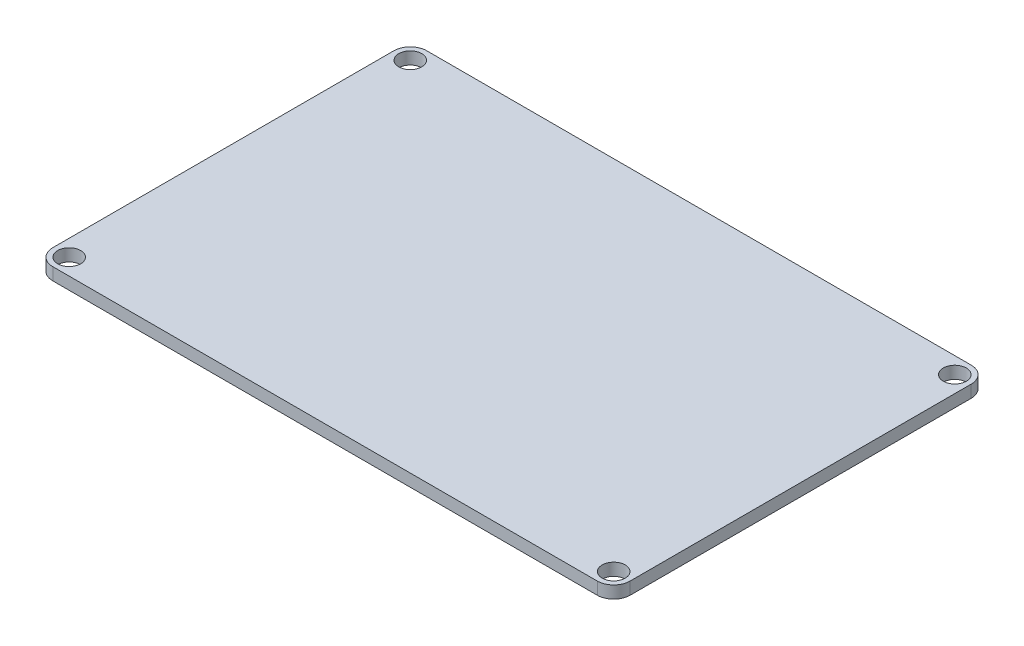
ISO-10303-21;
HEADER;
FILE_DESCRIPTION(('STEP AP214'),'2;1');
FILE_NAME('part.step','',(''),(''),'','','');
FILE_SCHEMA(('AUTOMOTIVE_DESIGN { 1 0 10303 214 1 1 1 1 }'));
ENDSEC;
DATA;
#1=APPLICATION_CONTEXT('core data for automotive mechanical design processes');
#2=APPLICATION_PROTOCOL_DEFINITION('international standard','automotive_design',2000,#1);
#3=PRODUCT_CONTEXT('',#1,'mechanical');
#4=PRODUCT('Part','Part','',(#3));
#5=PRODUCT_RELATED_PRODUCT_CATEGORY('part','',(#4));
#6=PRODUCT_DEFINITION_FORMATION('','',#4);
#7=PRODUCT_DEFINITION_CONTEXT('part definition',#1,'design');
#8=PRODUCT_DEFINITION('design','',#6,#7);
#9=PRODUCT_DEFINITION_SHAPE('','',#8);
#10=(LENGTH_UNIT() NAMED_UNIT(*) SI_UNIT(.MILLI.,.METRE.));
#11=(NAMED_UNIT(*) PLANE_ANGLE_UNIT() SI_UNIT($,.RADIAN.));
#12=(NAMED_UNIT(*) SI_UNIT($,.STERADIAN.) SOLID_ANGLE_UNIT());
#13=UNCERTAINTY_MEASURE_WITH_UNIT(LENGTH_MEASURE(1.E-05),#10,'distance_accuracy_value','');
#14=(GEOMETRIC_REPRESENTATION_CONTEXT(3) GLOBAL_UNCERTAINTY_ASSIGNED_CONTEXT((#13)) GLOBAL_UNIT_ASSIGNED_CONTEXT((#10,
#11,#12)) REPRESENTATION_CONTEXT('',''));
#15=CARTESIAN_POINT('',(0.,0.,0.));
#16=DIRECTION('',(0.,0.,1.));
#17=DIRECTION('',(1.,0.,0.));
#18=AXIS2_PLACEMENT_3D('',#15,#16,#17);
#19=CARTESIAN_POINT('',(-78.5,73.,41.5));
#20=DIRECTION('',(0.,1.,0.));
#21=DIRECTION('',(0.,0.,1.));
#22=AXIS2_PLACEMENT_3D('',#19,#20,#21);
#23=PLANE('',#22);
#24=CARTESIAN_POINT('',(-78.5,73.,41.5));
#25=DIRECTION('',(0.,1.,0.));
#26=DIRECTION('',(0.,0.,1.));
#27=AXIS2_PLACEMENT_3D('',#24,#25,#26);
#28=CIRCLE('',#27,2.79999999999999);
#29=CARTESIAN_POINT('',(-78.5,73.,44.3));
#30=VERTEX_POINT('',#29);
#31=EDGE_CURVE('E229',#30,#30,#28,.T.);
#32=ORIENTED_EDGE('',*,*,#31,.F.);
#33=EDGE_LOOP('',(#32));
#34=FACE_BOUND('',#33,.T.);
#35=CARTESIAN_POINT('',(54.,73.,-41.5));
#36=DIRECTION('',(0.,1.,0.));
#37=DIRECTION('',(0.,0.,1.));
#38=AXIS2_PLACEMENT_3D('',#35,#36,#37);
#39=CIRCLE('',#38,2.8);
#40=CARTESIAN_POINT('',(54.,73.,-38.7));
#41=VERTEX_POINT('',#40);
#42=EDGE_CURVE('E175',#41,#41,#39,.T.);
#43=ORIENTED_EDGE('',*,*,#42,.F.);
#44=EDGE_LOOP('',(#43));
#45=FACE_BOUND('',#44,.T.);
#46=CARTESIAN_POINT('',(-78.5,73.,41.5));
#47=DIRECTION('',(0.,1.,0.));
#48=DIRECTION('',(0.,0.,1.));
#49=AXIS2_PLACEMENT_3D('',#46,#47,#48);
#50=CIRCLE('',#49,4.);
#51=CARTESIAN_POINT('',(-82.5,73.,41.5));
#52=VERTEX_POINT('',#51);
#53=CARTESIAN_POINT('',(-78.5,73.,45.5));
#54=VERTEX_POINT('',#53);
#55=EDGE_CURVE('E186',#52,#54,#50,.T.);
#56=ORIENTED_EDGE('',*,*,#55,.T.);
#57=DIRECTION('',(1.,0.,0.));
#58=VECTOR('',#57,1.);
#59=CARTESIAN_POINT('',(-78.5,73.,45.5));
#60=LINE('',#59,#58);
#61=CARTESIAN_POINT('',(54.,73.,45.5));
#62=VERTEX_POINT('',#61);
#63=EDGE_CURVE('E134',#54,#62,#60,.T.);
#64=ORIENTED_EDGE('',*,*,#63,.T.);
#65=CARTESIAN_POINT('',(54.,73.,41.5));
#66=DIRECTION('',(0.,1.,0.));
#67=DIRECTION('',(0.,0.,1.));
#68=AXIS2_PLACEMENT_3D('',#65,#66,#67);
#69=CIRCLE('',#68,4.);
#70=CARTESIAN_POINT('',(58.,73.,41.5));
#71=VERTEX_POINT('',#70);
#72=EDGE_CURVE('E201',#62,#71,#69,.T.);
#73=ORIENTED_EDGE('',*,*,#72,.T.);
#74=DIRECTION('',(0.,0.,-1.));
#75=VECTOR('',#74,1.);
#76=CARTESIAN_POINT('',(58.,73.,41.5));
#77=LINE('',#76,#75);
#78=CARTESIAN_POINT('',(58.,73.,-41.5));
#79=VERTEX_POINT('',#78);
#80=EDGE_CURVE('E214',#71,#79,#77,.T.);
#81=ORIENTED_EDGE('',*,*,#80,.T.);
#82=CARTESIAN_POINT('',(54.,73.,-41.5));
#83=DIRECTION('',(0.,1.,0.));
#84=DIRECTION('',(0.,0.,1.));
#85=AXIS2_PLACEMENT_3D('',#82,#83,#84);
#86=CIRCLE('',#85,4.);
#87=CARTESIAN_POINT('',(54.,73.,-45.5));
#88=VERTEX_POINT('',#87);
#89=EDGE_CURVE('E153',#79,#88,#86,.T.);
#90=ORIENTED_EDGE('',*,*,#89,.T.);
#91=DIRECTION('',(-1.,0.,0.));
#92=VECTOR('',#91,1.);
#93=CARTESIAN_POINT('',(-78.5,73.,-45.5));
#94=LINE('',#93,#92);
#95=CARTESIAN_POINT('',(-78.5,73.,-45.5));
#96=VERTEX_POINT('',#95);
#97=EDGE_CURVE('E147',#88,#96,#94,.T.);
#98=ORIENTED_EDGE('',*,*,#97,.T.);
#99=CARTESIAN_POINT('',(-78.5,73.,-41.5));
#100=DIRECTION('',(0.,1.,0.));
#101=DIRECTION('',(0.,0.,1.));
#102=AXIS2_PLACEMENT_3D('',#99,#100,#101);
#103=CIRCLE('',#102,4.);
#104=CARTESIAN_POINT('',(-82.5,73.,-41.5));
#105=VERTEX_POINT('',#104);
#106=EDGE_CURVE('E151',#96,#105,#103,.T.);
#107=ORIENTED_EDGE('',*,*,#106,.T.);
#108=DIRECTION('',(0.,0.,1.));
#109=VECTOR('',#108,1.);
#110=CARTESIAN_POINT('',(-82.5,73.,41.5));
#111=LINE('',#110,#109);
#112=EDGE_CURVE('E91',#105,#52,#111,.T.);
#113=ORIENTED_EDGE('',*,*,#112,.T.);
#114=EDGE_LOOP('',(#56,#64,#73,#81,#90,#98,#107,#113));
#115=FACE_BOUND('',#114,.T.);
#116=CARTESIAN_POINT('',(54.,73.,41.5));
#117=DIRECTION('',(0.,1.,0.));
#118=DIRECTION('',(0.,0.,1.));
#119=AXIS2_PLACEMENT_3D('',#116,#117,#118);
#120=CIRCLE('',#119,2.8);
#121=CARTESIAN_POINT('',(54.,73.,44.3));
#122=VERTEX_POINT('',#121);
#123=EDGE_CURVE('E223',#122,#122,#120,.T.);
#124=ORIENTED_EDGE('',*,*,#123,.F.);
#125=EDGE_LOOP('',(#124));
#126=FACE_BOUND('',#125,.T.);
#127=CARTESIAN_POINT('',(-78.5,73.,-41.5));
#128=DIRECTION('',(0.,1.,0.));
#129=DIRECTION('',(0.,0.,1.));
#130=AXIS2_PLACEMENT_3D('',#127,#128,#129);
#131=CIRCLE('',#130,2.79999999999999);
#132=CARTESIAN_POINT('',(-78.5,73.,-38.7));
#133=VERTEX_POINT('',#132);
#134=EDGE_CURVE('E235',#133,#133,#131,.T.);
#135=ORIENTED_EDGE('',*,*,#134,.F.);
#136=EDGE_LOOP('',(#135));
#137=FACE_BOUND('',#136,.T.);
#138=ADVANCED_FACE('F74',(#34,#45,#115,#126,#137),#23,.T.);
#139=CARTESIAN_POINT('',(-78.5,70.,41.5));
#140=DIRECTION('',(0.,1.,0.));
#141=DIRECTION('',(0.,0.,1.));
#142=AXIS2_PLACEMENT_3D('',#139,#140,#141);
#143=PLANE('',#142);
#144=CARTESIAN_POINT('',(-78.5,70.,41.5));
#145=DIRECTION('',(0.,1.,0.));
#146=DIRECTION('',(0.,0.,1.));
#147=AXIS2_PLACEMENT_3D('',#144,#145,#146);
#148=CIRCLE('',#147,4.);
#149=CARTESIAN_POINT('',(-82.5,70.,41.5));
#150=VERTEX_POINT('',#149);
#151=CARTESIAN_POINT('',(-78.5,70.,45.5));
#152=VERTEX_POINT('',#151);
#153=EDGE_CURVE('E171',#150,#152,#148,.T.);
#154=ORIENTED_EDGE('',*,*,#153,.F.);
#155=DIRECTION('',(0.,0.,1.));
#156=VECTOR('',#155,1.);
#157=CARTESIAN_POINT('',(-82.5,70.,41.5));
#158=LINE('',#157,#156);
#159=CARTESIAN_POINT('',(-82.5,70.,-41.5));
#160=VERTEX_POINT('',#159);
#161=EDGE_CURVE('E126',#160,#150,#158,.T.);
#162=ORIENTED_EDGE('',*,*,#161,.F.);
#163=CARTESIAN_POINT('',(-78.5,70.,-41.5));
#164=DIRECTION('',(0.,1.,0.));
#165=DIRECTION('',(0.,0.,1.));
#166=AXIS2_PLACEMENT_3D('',#163,#164,#165);
#167=CIRCLE('',#166,4.);
#168=CARTESIAN_POINT('',(-78.5,70.,-45.5));
#169=VERTEX_POINT('',#168);
#170=EDGE_CURVE('E120',#169,#160,#167,.T.);
#171=ORIENTED_EDGE('',*,*,#170,.F.);
#172=DIRECTION('',(-1.,0.,0.));
#173=VECTOR('',#172,1.);
#174=CARTESIAN_POINT('',(-78.5,70.,-45.5));
#175=LINE('',#174,#173);
#176=CARTESIAN_POINT('',(54.,70.,-45.5));
#177=VERTEX_POINT('',#176);
#178=EDGE_CURVE('E161',#177,#169,#175,.T.);
#179=ORIENTED_EDGE('',*,*,#178,.F.);
#180=CARTESIAN_POINT('',(54.,70.,-41.5));
#181=DIRECTION('',(0.,1.,0.));
#182=DIRECTION('',(0.,0.,1.));
#183=AXIS2_PLACEMENT_3D('',#180,#181,#182);
#184=CIRCLE('',#183,4.);
#185=CARTESIAN_POINT('',(58.,70.,-41.5));
#186=VERTEX_POINT('',#185);
#187=EDGE_CURVE('E181',#186,#177,#184,.T.);
#188=ORIENTED_EDGE('',*,*,#187,.F.);
#189=DIRECTION('',(0.,0.,-1.));
#190=VECTOR('',#189,1.);
#191=CARTESIAN_POINT('',(58.,70.,41.5));
#192=LINE('',#191,#190);
#193=CARTESIAN_POINT('',(58.,70.,41.5));
#194=VERTEX_POINT('',#193);
#195=EDGE_CURVE('E179',#194,#186,#192,.T.);
#196=ORIENTED_EDGE('',*,*,#195,.F.);
#197=CARTESIAN_POINT('',(54.,70.,41.5));
#198=DIRECTION('',(0.,1.,0.));
#199=DIRECTION('',(0.,0.,1.));
#200=AXIS2_PLACEMENT_3D('',#197,#198,#199);
#201=CIRCLE('',#200,4.);
#202=CARTESIAN_POINT('',(54.,70.,45.5));
#203=VERTEX_POINT('',#202);
#204=EDGE_CURVE('E177',#203,#194,#201,.T.);
#205=ORIENTED_EDGE('',*,*,#204,.F.);
#206=DIRECTION('',(1.,0.,0.));
#207=VECTOR('',#206,1.);
#208=CARTESIAN_POINT('',(-78.5,70.,45.5));
#209=LINE('',#208,#207);
#210=EDGE_CURVE('E174',#152,#203,#209,.T.);
#211=ORIENTED_EDGE('',*,*,#210,.F.);
#212=EDGE_LOOP('',(#154,#162,#171,#179,#188,#196,#205,#211));
#213=FACE_BOUND('',#212,.T.);
#214=CARTESIAN_POINT('',(54.,70.,-41.5));
#215=DIRECTION('',(0.,1.,0.));
#216=DIRECTION('',(0.,0.,1.));
#217=AXIS2_PLACEMENT_3D('',#214,#215,#216);
#218=CIRCLE('',#217,2.8);
#219=CARTESIAN_POINT('',(54.,70.,-38.7));
#220=VERTEX_POINT('',#219);
#221=EDGE_CURVE('E220',#220,#220,#218,.T.);
#222=ORIENTED_EDGE('',*,*,#221,.T.);
#223=EDGE_LOOP('',(#222));
#224=FACE_BOUND('',#223,.T.);
#225=CARTESIAN_POINT('',(54.,70.,41.5));
#226=DIRECTION('',(0.,1.,0.));
#227=DIRECTION('',(0.,0.,1.));
#228=AXIS2_PLACEMENT_3D('',#225,#226,#227);
#229=CIRCLE('',#228,2.8);
#230=CARTESIAN_POINT('',(54.,70.,44.3));
#231=VERTEX_POINT('',#230);
#232=EDGE_CURVE('E226',#231,#231,#229,.T.);
#233=ORIENTED_EDGE('',*,*,#232,.T.);
#234=EDGE_LOOP('',(#233));
#235=FACE_BOUND('',#234,.T.);
#236=CARTESIAN_POINT('',(-78.5,70.,41.5));
#237=DIRECTION('',(0.,1.,0.));
#238=DIRECTION('',(0.,0.,1.));
#239=AXIS2_PLACEMENT_3D('',#236,#237,#238);
#240=CIRCLE('',#239,2.79999999999999);
#241=CARTESIAN_POINT('',(-78.5,70.,44.3));
#242=VERTEX_POINT('',#241);
#243=EDGE_CURVE('E232',#242,#242,#240,.T.);
#244=ORIENTED_EDGE('',*,*,#243,.T.);
#245=EDGE_LOOP('',(#244));
#246=FACE_BOUND('',#245,.T.);
#247=CARTESIAN_POINT('',(-78.5,70.,-41.5));
#248=DIRECTION('',(0.,1.,0.));
#249=DIRECTION('',(0.,0.,1.));
#250=AXIS2_PLACEMENT_3D('',#247,#248,#249);
#251=CIRCLE('',#250,2.79999999999999);
#252=CARTESIAN_POINT('',(-78.5,70.,-38.7));
#253=VERTEX_POINT('',#252);
#254=EDGE_CURVE('E238',#253,#253,#251,.T.);
#255=ORIENTED_EDGE('',*,*,#254,.T.);
#256=EDGE_LOOP('',(#255));
#257=FACE_BOUND('',#256,.T.);
#258=ADVANCED_FACE('F205',(#213,#224,#235,#246,#257),#143,.F.);
#259=CARTESIAN_POINT('',(-78.5,73.,41.5));
#260=DIRECTION('',(0.,-1.,0.));
#261=DIRECTION('',(0.,0.,-1.));
#262=AXIS2_PLACEMENT_3D('',#259,#260,#261);
#263=CYLINDRICAL_SURFACE('',#262,4.);
#264=ORIENTED_EDGE('',*,*,#153,.T.);
#265=DIRECTION('',(0.,-1.,0.));
#266=VECTOR('',#265,1.);
#267=CARTESIAN_POINT('',(-78.5,73.,45.5));
#268=LINE('',#267,#266);
#269=EDGE_CURVE('E12',#54,#152,#268,.T.);
#270=ORIENTED_EDGE('',*,*,#269,.F.);
#271=ORIENTED_EDGE('',*,*,#55,.F.);
#272=DIRECTION('',(0.,-1.,0.));
#273=VECTOR('',#272,1.);
#274=CARTESIAN_POINT('',(-82.5,73.,41.5));
#275=LINE('',#274,#273);
#276=EDGE_CURVE('E167',#52,#150,#275,.T.);
#277=ORIENTED_EDGE('',*,*,#276,.T.);
#278=EDGE_LOOP('',(#264,#270,#271,#277));
#279=FACE_BOUND('',#278,.T.);
#280=ADVANCED_FACE('F76',(#279),#263,.T.);
#281=CARTESIAN_POINT('',(-78.5,73.,45.5));
#282=DIRECTION('',(0.,0.,-1.));
#283=DIRECTION('',(-1.,0.,0.));
#284=AXIS2_PLACEMENT_3D('',#281,#282,#283);
#285=PLANE('',#284);
#286=ORIENTED_EDGE('',*,*,#210,.T.);
#287=DIRECTION('',(0.,-1.,0.));
#288=VECTOR('',#287,1.);
#289=CARTESIAN_POINT('',(54.,73.,45.5));
#290=LINE('',#289,#288);
#291=EDGE_CURVE('E83',#62,#203,#290,.T.);
#292=ORIENTED_EDGE('',*,*,#291,.F.);
#293=ORIENTED_EDGE('',*,*,#63,.F.);
#294=ORIENTED_EDGE('',*,*,#269,.T.);
#295=EDGE_LOOP('',(#286,#292,#293,#294));
#296=FACE_BOUND('',#295,.T.);
#297=ADVANCED_FACE('F272',(#296),#285,.F.);
#298=CARTESIAN_POINT('',(54.,73.,41.5));
#299=DIRECTION('',(0.,-1.,0.));
#300=DIRECTION('',(0.,0.,-1.));
#301=AXIS2_PLACEMENT_3D('',#298,#299,#300);
#302=CYLINDRICAL_SURFACE('',#301,4.);
#303=ORIENTED_EDGE('',*,*,#204,.T.);
#304=DIRECTION('',(0.,-1.,0.));
#305=VECTOR('',#304,1.);
#306=CARTESIAN_POINT('',(58.,73.,41.5));
#307=LINE('',#306,#305);
#308=EDGE_CURVE('E193',#71,#194,#307,.T.);
#309=ORIENTED_EDGE('',*,*,#308,.F.);
#310=ORIENTED_EDGE('',*,*,#72,.F.);
#311=ORIENTED_EDGE('',*,*,#291,.T.);
#312=EDGE_LOOP('',(#303,#309,#310,#311));
#313=FACE_BOUND('',#312,.T.);
#314=ADVANCED_FACE('F199',(#313),#302,.T.);
#315=CARTESIAN_POINT('',(58.,73.,41.5));
#316=DIRECTION('',(-1.,0.,0.));
#317=DIRECTION('',(0.,0.,1.));
#318=AXIS2_PLACEMENT_3D('',#315,#316,#317);
#319=PLANE('',#318);
#320=ORIENTED_EDGE('',*,*,#195,.T.);
#321=DIRECTION('',(0.,-1.,0.));
#322=VECTOR('',#321,1.);
#323=CARTESIAN_POINT('',(58.,73.,-41.5));
#324=LINE('',#323,#322);
#325=EDGE_CURVE('E190',#79,#186,#324,.T.);
#326=ORIENTED_EDGE('',*,*,#325,.F.);
#327=ORIENTED_EDGE('',*,*,#80,.F.);
#328=ORIENTED_EDGE('',*,*,#308,.T.);
#329=EDGE_LOOP('',(#320,#326,#327,#328));
#330=FACE_BOUND('',#329,.T.);
#331=ADVANCED_FACE('F210',(#330),#319,.F.);
#332=CARTESIAN_POINT('',(54.,73.,-41.5));
#333=DIRECTION('',(0.,-1.,0.));
#334=DIRECTION('',(0.,0.,-1.));
#335=AXIS2_PLACEMENT_3D('',#332,#333,#334);
#336=CYLINDRICAL_SURFACE('',#335,4.);
#337=ORIENTED_EDGE('',*,*,#187,.T.);
#338=DIRECTION('',(0.,-1.,0.));
#339=VECTOR('',#338,1.);
#340=CARTESIAN_POINT('',(54.,73.,-45.5));
#341=LINE('',#340,#339);
#342=EDGE_CURVE('E162',#88,#177,#341,.T.);
#343=ORIENTED_EDGE('',*,*,#342,.F.);
#344=ORIENTED_EDGE('',*,*,#89,.F.);
#345=ORIENTED_EDGE('',*,*,#325,.T.);
#346=EDGE_LOOP('',(#337,#343,#344,#345));
#347=FACE_BOUND('',#346,.T.);
#348=ADVANCED_FACE('F213',(#347),#336,.T.);
#349=CARTESIAN_POINT('',(-78.5,73.,-45.5));
#350=DIRECTION('',(0.,0.,1.));
#351=DIRECTION('',(1.,0.,0.));
#352=AXIS2_PLACEMENT_3D('',#349,#350,#351);
#353=PLANE('',#352);
#354=ORIENTED_EDGE('',*,*,#178,.T.);
#355=DIRECTION('',(0.,-1.,0.));
#356=VECTOR('',#355,1.);
#357=CARTESIAN_POINT('',(-78.5,73.,-45.5));
#358=LINE('',#357,#356);
#359=EDGE_CURVE('E158',#96,#169,#358,.T.);
#360=ORIENTED_EDGE('',*,*,#359,.F.);
#361=ORIENTED_EDGE('',*,*,#97,.F.);
#362=ORIENTED_EDGE('',*,*,#342,.T.);
#363=EDGE_LOOP('',(#354,#360,#361,#362));
#364=FACE_BOUND('',#363,.T.);
#365=ADVANCED_FACE('F159',(#364),#353,.F.);
#366=CARTESIAN_POINT('',(-78.5,73.,-41.5));
#367=DIRECTION('',(0.,-1.,0.));
#368=DIRECTION('',(0.,0.,-1.));
#369=AXIS2_PLACEMENT_3D('',#366,#367,#368);
#370=CYLINDRICAL_SURFACE('',#369,4.);
#371=ORIENTED_EDGE('',*,*,#170,.T.);
#372=DIRECTION('',(0.,-1.,0.));
#373=VECTOR('',#372,1.);
#374=CARTESIAN_POINT('',(-82.5,73.,-41.5));
#375=LINE('',#374,#373);
#376=EDGE_CURVE('E163',#105,#160,#375,.T.);
#377=ORIENTED_EDGE('',*,*,#376,.F.);
#378=ORIENTED_EDGE('',*,*,#106,.F.);
#379=ORIENTED_EDGE('',*,*,#359,.T.);
#380=EDGE_LOOP('',(#371,#377,#378,#379));
#381=FACE_BOUND('',#380,.T.);
#382=ADVANCED_FACE('F165',(#381),#370,.T.);
#383=CARTESIAN_POINT('',(-82.5,73.,41.5));
#384=DIRECTION('',(1.,0.,0.));
#385=DIRECTION('',(0.,0.,-1.));
#386=AXIS2_PLACEMENT_3D('',#383,#384,#385);
#387=PLANE('',#386);
#388=ORIENTED_EDGE('',*,*,#161,.T.);
#389=ORIENTED_EDGE('',*,*,#276,.F.);
#390=ORIENTED_EDGE('',*,*,#112,.F.);
#391=ORIENTED_EDGE('',*,*,#376,.T.);
#392=EDGE_LOOP('',(#388,#389,#390,#391));
#393=FACE_BOUND('',#392,.T.);
#394=ADVANCED_FACE('F260',(#393),#387,.F.);
#395=CARTESIAN_POINT('',(54.,73.,-41.5));
#396=DIRECTION('',(0.,-1.,0.));
#397=DIRECTION('',(0.,0.,-1.));
#398=AXIS2_PLACEMENT_3D('',#395,#396,#397);
#399=CYLINDRICAL_SURFACE('',#398,2.8);
#400=ORIENTED_EDGE('',*,*,#42,.T.);
#401=EDGE_LOOP('',(#400));
#402=FACE_BOUND('',#401,.T.);
#403=ORIENTED_EDGE('',*,*,#221,.F.);
#404=EDGE_LOOP('',(#403));
#405=FACE_BOUND('',#404,.T.);
#406=ADVANCED_FACE('F257',(#402,#405),#399,.F.);
#407=CARTESIAN_POINT('',(54.,73.,41.5));
#408=DIRECTION('',(0.,-1.,0.));
#409=DIRECTION('',(0.,0.,-1.));
#410=AXIS2_PLACEMENT_3D('',#407,#408,#409);
#411=CYLINDRICAL_SURFACE('',#410,2.8);
#412=ORIENTED_EDGE('',*,*,#123,.T.);
#413=EDGE_LOOP('',(#412));
#414=FACE_BOUND('',#413,.T.);
#415=ORIENTED_EDGE('',*,*,#232,.F.);
#416=EDGE_LOOP('',(#415));
#417=FACE_BOUND('',#416,.T.);
#418=ADVANCED_FACE('F336',(#414,#417),#411,.F.);
#419=CARTESIAN_POINT('',(-78.5,73.,41.5));
#420=DIRECTION('',(0.,-1.,0.));
#421=DIRECTION('',(0.,0.,-1.));
#422=AXIS2_PLACEMENT_3D('',#419,#420,#421);
#423=CYLINDRICAL_SURFACE('',#422,2.79999999999999);
#424=ORIENTED_EDGE('',*,*,#31,.T.);
#425=EDGE_LOOP('',(#424));
#426=FACE_BOUND('',#425,.T.);
#427=ORIENTED_EDGE('',*,*,#243,.F.);
#428=EDGE_LOOP('',(#427));
#429=FACE_BOUND('',#428,.T.);
#430=ADVANCED_FACE('F344',(#426,#429),#423,.F.);
#431=CARTESIAN_POINT('',(-78.5,73.,-41.5));
#432=DIRECTION('',(0.,-1.,0.));
#433=DIRECTION('',(0.,0.,-1.));
#434=AXIS2_PLACEMENT_3D('',#431,#432,#433);
#435=CYLINDRICAL_SURFACE('',#434,2.79999999999999);
#436=ORIENTED_EDGE('',*,*,#134,.T.);
#437=EDGE_LOOP('',(#436));
#438=FACE_BOUND('',#437,.T.);
#439=ORIENTED_EDGE('',*,*,#254,.F.);
#440=EDGE_LOOP('',(#439));
#441=FACE_BOUND('',#440,.T.);
#442=ADVANCED_FACE('F244',(#438,#441),#435,.F.);
#443=CLOSED_SHELL('',(#138,#258,#280,#297,#314,#331,#348,#365,#382,#394,#406,#418,#430,#442));
#444=MANIFOLD_SOLID_BREP('B2',#443);
#445=ADVANCED_BREP_SHAPE_REPRESENTATION('',(#18,#444),#14);
#446=SHAPE_DEFINITION_REPRESENTATION(#9,#445);
ENDSEC;
END-ISO-10303-21;
